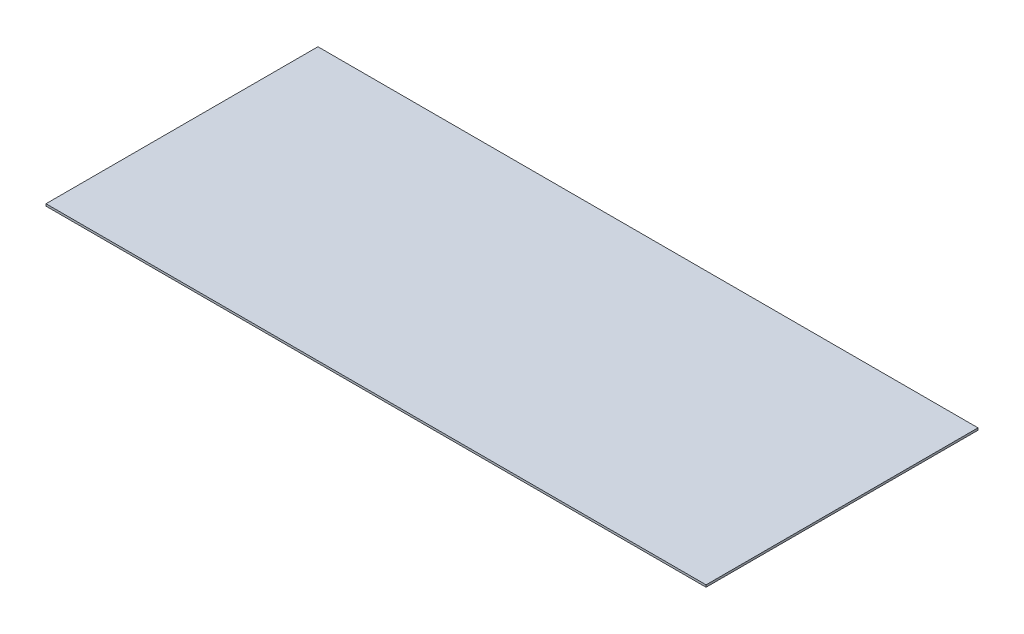
ISO-10303-21;
HEADER;
FILE_DESCRIPTION(('STEP AP214'),'2;1');
FILE_NAME('part.step','',(''),(''),'','','');
FILE_SCHEMA(('AUTOMOTIVE_DESIGN { 1 0 10303 214 1 1 1 1 }'));
ENDSEC;
DATA;
#1=APPLICATION_CONTEXT('core data for automotive mechanical design processes');
#2=APPLICATION_PROTOCOL_DEFINITION('international standard','automotive_design',2000,#1);
#3=PRODUCT_CONTEXT('',#1,'mechanical');
#4=PRODUCT('Part','Part','',(#3));
#5=PRODUCT_RELATED_PRODUCT_CATEGORY('part','',(#4));
#6=PRODUCT_DEFINITION_FORMATION('','',#4);
#7=PRODUCT_DEFINITION_CONTEXT('part definition',#1,'design');
#8=PRODUCT_DEFINITION('design','',#6,#7);
#9=PRODUCT_DEFINITION_SHAPE('','',#8);
#10=(LENGTH_UNIT() NAMED_UNIT(*) SI_UNIT(.MILLI.,.METRE.));
#11=(NAMED_UNIT(*) PLANE_ANGLE_UNIT() SI_UNIT($,.RADIAN.));
#12=(NAMED_UNIT(*) SI_UNIT($,.STERADIAN.) SOLID_ANGLE_UNIT());
#13=UNCERTAINTY_MEASURE_WITH_UNIT(LENGTH_MEASURE(1.E-05),#10,'distance_accuracy_value','');
#14=(GEOMETRIC_REPRESENTATION_CONTEXT(3) GLOBAL_UNCERTAINTY_ASSIGNED_CONTEXT((#13)) GLOBAL_UNIT_ASSIGNED_CONTEXT((#10,
#11,#12)) REPRESENTATION_CONTEXT('',''));
#15=CARTESIAN_POINT('',(0.,0.,0.));
#16=DIRECTION('',(0.,0.,1.));
#17=DIRECTION('',(1.,0.,0.));
#18=AXIS2_PLACEMENT_3D('',#15,#16,#17);
#19=CARTESIAN_POINT('',(0.,-1.5875,0.));
#20=DIRECTION('',(0.,1.,0.));
#21=DIRECTION('',(0.,0.,1.));
#22=AXIS2_PLACEMENT_3D('',#19,#20,#21);
#23=PLANE('',#22);
#24=DIRECTION('',(1.,0.,0.));
#25=VECTOR('',#24,1.);
#26=CARTESIAN_POINT('',(-222.25,-1.5875,101.6));
#27=LINE('',#26,#25);
#28=CARTESIAN_POINT('',(-246.62795875318,-1.5874999999998,101.6));
#29=VERTEX_POINT('',#28);
#30=CARTESIAN_POINT('',(246.62795875318,-1.58749999999983,101.6));
#31=VERTEX_POINT('',#30);
#32=EDGE_CURVE('E13',#29,#31,#27,.T.);
#33=ORIENTED_EDGE('',*,*,#32,.F.);
#34=DIRECTION('',(0.,0.,-1.));
#35=VECTOR('',#34,1.);
#36=CARTESIAN_POINT('',(-246.62795875318,-1.5874999999998,101.6));
#37=LINE('',#36,#35);
#38=CARTESIAN_POINT('',(-246.62795875318,-1.58749999999977,-101.6));
#39=VERTEX_POINT('',#38);
#40=EDGE_CURVE('E135',#39,#29,#37,.F.);
#41=ORIENTED_EDGE('',*,*,#40,.F.);
#42=DIRECTION('',(-1.,0.,0.));
#43=VECTOR('',#42,1.);
#44=CARTESIAN_POINT('',(-222.25,-1.5875,-101.6));
#45=LINE('',#44,#43);
#46=CARTESIAN_POINT('',(246.62795875318,-1.58749999999985,-101.6));
#47=VERTEX_POINT('',#46);
#48=EDGE_CURVE('E95',#47,#39,#45,.T.);
#49=ORIENTED_EDGE('',*,*,#48,.F.);
#50=DIRECTION('',(0.,0.,1.));
#51=VECTOR('',#50,1.);
#52=CARTESIAN_POINT('',(246.62795875318,-1.58749999999985,-101.6));
#53=LINE('',#52,#51);
#54=EDGE_CURVE('E133',#31,#47,#53,.F.);
#55=ORIENTED_EDGE('',*,*,#54,.F.);
#56=EDGE_LOOP('',(#33,#41,#49,#55));
#57=FACE_BOUND('',#56,.T.);
#58=ADVANCED_FACE('F85',(#57),#23,.F.);
#59=CARTESIAN_POINT('',(0.,0.,0.));
#60=DIRECTION('',(0.,1.,0.));
#61=DIRECTION('',(0.,0.,1.));
#62=AXIS2_PLACEMENT_3D('',#59,#60,#61);
#63=PLANE('',#62);
#64=DIRECTION('',(-1.,0.,0.));
#65=VECTOR('',#64,1.);
#66=CARTESIAN_POINT('',(-222.25,0.,-101.6));
#67=LINE('',#66,#65);
#68=CARTESIAN_POINT('',(246.62795875318,1.38777878078145E-13,-101.6));
#69=VERTEX_POINT('',#68);
#70=CARTESIAN_POINT('',(-246.62795875318,2.22044604925031E-13,-101.6));
#71=VERTEX_POINT('',#70);
#72=EDGE_CURVE('E116',#69,#71,#67,.T.);
#73=ORIENTED_EDGE('',*,*,#72,.T.);
#74=DIRECTION('',(0.,0.,1.));
#75=VECTOR('',#74,1.);
#76=CARTESIAN_POINT('',(-246.62795875318,1.94289029309402E-13,0.));
#77=LINE('',#76,#75);
#78=CARTESIAN_POINT('',(-246.62795875318,1.94289029309402E-13,101.6));
#79=VERTEX_POINT('',#78);
#80=EDGE_CURVE('E150',#71,#79,#77,.T.);
#81=ORIENTED_EDGE('',*,*,#80,.T.);
#82=DIRECTION('',(1.,0.,0.));
#83=VECTOR('',#82,1.);
#84=CARTESIAN_POINT('',(-222.25,0.,101.6));
#85=LINE('',#84,#83);
#86=CARTESIAN_POINT('',(246.62795875318,1.66533453693773E-13,101.6));
#87=VERTEX_POINT('',#86);
#88=EDGE_CURVE('E89',#79,#87,#85,.T.);
#89=ORIENTED_EDGE('',*,*,#88,.T.);
#90=DIRECTION('',(0.,0.,-1.));
#91=VECTOR('',#90,1.);
#92=CARTESIAN_POINT('',(246.62795875318,1.38777878078145E-13,0.));
#93=LINE('',#92,#91);
#94=EDGE_CURVE('E145',#87,#69,#93,.T.);
#95=ORIENTED_EDGE('',*,*,#94,.T.);
#96=EDGE_LOOP('',(#73,#81,#89,#95));
#97=FACE_BOUND('',#96,.T.);
#98=ADVANCED_FACE('F87',(#97),#63,.T.);
#99=CARTESIAN_POINT('',(-222.25,-1.5875,-101.6));
#100=DIRECTION('',(0.,0.,-1.));
#101=DIRECTION('',(-1.,0.,0.));
#102=AXIS2_PLACEMENT_3D('',#99,#100,#101);
#103=PLANE('',#102);
#104=ORIENTED_EDGE('',*,*,#48,.T.);
#105=DIRECTION('',(0.,-1.,0.));
#106=VECTOR('',#105,1.);
#107=CARTESIAN_POINT('',(-246.62795875318,2.22044604925031E-13,-101.6));
#108=LINE('',#107,#106);
#109=EDGE_CURVE('E154',#71,#39,#108,.T.);
#110=ORIENTED_EDGE('',*,*,#109,.F.);
#111=ORIENTED_EDGE('',*,*,#72,.F.);
#112=DIRECTION('',(0.,-1.,0.));
#113=VECTOR('',#112,1.);
#114=CARTESIAN_POINT('',(246.62795875318,1.11022302462516E-13,-101.6));
#115=LINE('',#114,#113);
#116=EDGE_CURVE('E141',#69,#47,#115,.T.);
#117=ORIENTED_EDGE('',*,*,#116,.T.);
#118=EDGE_LOOP('',(#104,#110,#111,#117));
#119=FACE_BOUND('',#118,.T.);
#120=ADVANCED_FACE('F144',(#119),#103,.T.);
#121=CARTESIAN_POINT('',(-222.25,-1.5875,101.6));
#122=DIRECTION('',(0.,0.,1.));
#123=DIRECTION('',(1.,0.,0.));
#124=AXIS2_PLACEMENT_3D('',#121,#122,#123);
#125=PLANE('',#124);
#126=ORIENTED_EDGE('',*,*,#88,.F.);
#127=DIRECTION('',(0.,-1.,0.));
#128=VECTOR('',#127,1.);
#129=CARTESIAN_POINT('',(-246.62795875318,1.94289029309402E-13,101.6));
#130=LINE('',#129,#128);
#131=EDGE_CURVE('E152',#79,#29,#130,.T.);
#132=ORIENTED_EDGE('',*,*,#131,.T.);
#133=ORIENTED_EDGE('',*,*,#32,.T.);
#134=DIRECTION('',(0.,-1.,0.));
#135=VECTOR('',#134,1.);
#136=CARTESIAN_POINT('',(246.62795875318,1.38777878078145E-13,101.6));
#137=LINE('',#136,#135);
#138=EDGE_CURVE('E142',#87,#31,#137,.T.);
#139=ORIENTED_EDGE('',*,*,#138,.F.);
#140=EDGE_LOOP('',(#126,#132,#133,#139));
#141=FACE_BOUND('',#140,.T.);
#142=ADVANCED_FACE('F159',(#141),#125,.T.);
#143=CARTESIAN_POINT('',(-246.62795875318,1.94289029309402E-13,101.6));
#144=DIRECTION('',(1.,0.,0.));
#145=DIRECTION('',(0.,1.,0.));
#146=AXIS2_PLACEMENT_3D('',#143,#144,#145);
#147=PLANE('',#146);
#148=ORIENTED_EDGE('',*,*,#40,.T.);
#149=ORIENTED_EDGE('',*,*,#131,.F.);
#150=ORIENTED_EDGE('',*,*,#80,.F.);
#151=ORIENTED_EDGE('',*,*,#109,.T.);
#152=EDGE_LOOP('',(#148,#149,#150,#151));
#153=FACE_BOUND('',#152,.T.);
#154=ADVANCED_FACE('F158',(#153),#147,.F.);
#155=CARTESIAN_POINT('',(246.62795875318,1.11022302462516E-13,-101.6));
#156=DIRECTION('',(-1.,0.,0.));
#157=DIRECTION('',(0.,-1.,0.));
#158=AXIS2_PLACEMENT_3D('',#155,#156,#157);
#159=PLANE('',#158);
#160=ORIENTED_EDGE('',*,*,#54,.T.);
#161=ORIENTED_EDGE('',*,*,#116,.F.);
#162=ORIENTED_EDGE('',*,*,#94,.F.);
#163=ORIENTED_EDGE('',*,*,#138,.T.);
#164=EDGE_LOOP('',(#160,#161,#162,#163));
#165=FACE_BOUND('',#164,.T.);
#166=ADVANCED_FACE('F140',(#165),#159,.F.);
#167=CLOSED_SHELL('',(#58,#98,#120,#142,#154,#166));
#168=MANIFOLD_SOLID_BREP('B2',#167);
#169=ADVANCED_BREP_SHAPE_REPRESENTATION('',(#18,#168),#14);
#170=SHAPE_DEFINITION_REPRESENTATION(#9,#169);
ENDSEC;
END-ISO-10303-21;
